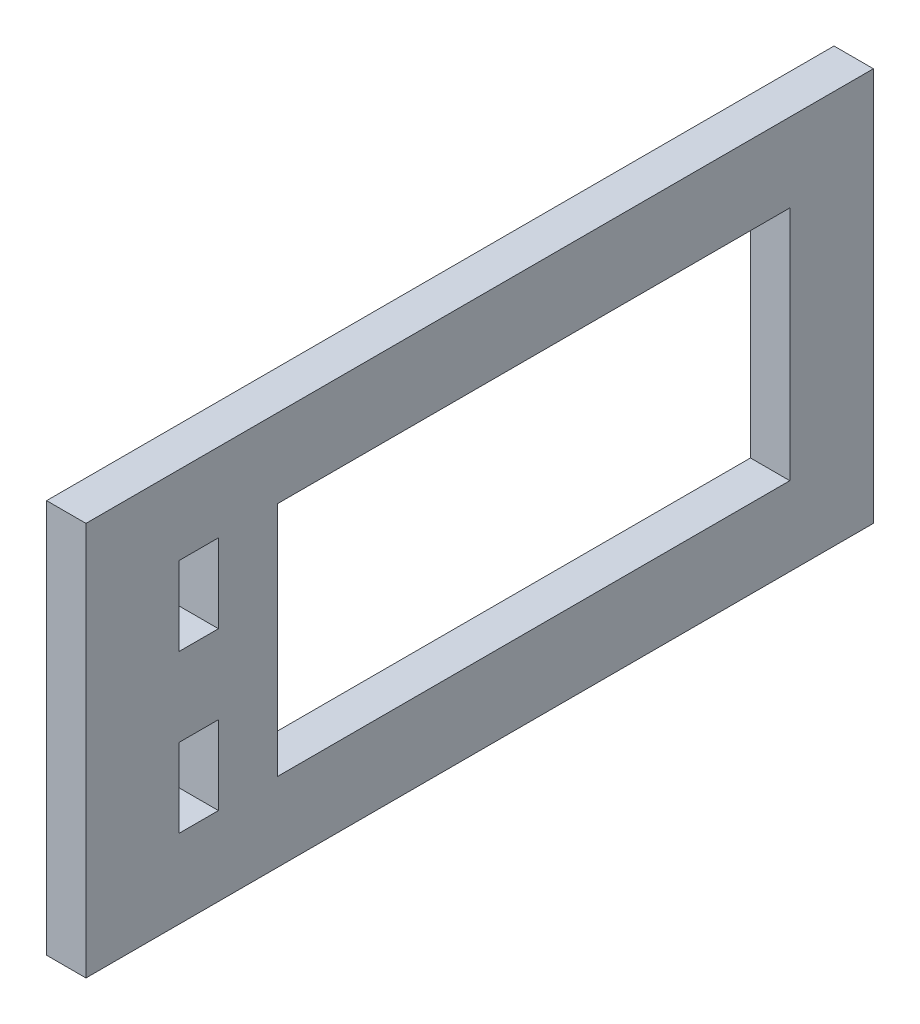
ISO-10303-21;
HEADER;
FILE_DESCRIPTION(('STEP AP214'),'2;1');
FILE_NAME('part.step','',(''),(''),'','','');
FILE_SCHEMA(('AUTOMOTIVE_DESIGN { 1 0 10303 214 1 1 1 1 }'));
ENDSEC;
DATA;
#1=APPLICATION_CONTEXT('core data for automotive mechanical design processes');
#2=APPLICATION_PROTOCOL_DEFINITION('international standard','automotive_design',2000,#1);
#3=PRODUCT_CONTEXT('',#1,'mechanical');
#4=PRODUCT('Part','Part','',(#3));
#5=PRODUCT_RELATED_PRODUCT_CATEGORY('part','',(#4));
#6=PRODUCT_DEFINITION_FORMATION('','',#4);
#7=PRODUCT_DEFINITION_CONTEXT('part definition',#1,'design');
#8=PRODUCT_DEFINITION('design','',#6,#7);
#9=PRODUCT_DEFINITION_SHAPE('','',#8);
#10=(LENGTH_UNIT() NAMED_UNIT(*) SI_UNIT(.MILLI.,.METRE.));
#11=(NAMED_UNIT(*) PLANE_ANGLE_UNIT() SI_UNIT($,.RADIAN.));
#12=(NAMED_UNIT(*) SI_UNIT($,.STERADIAN.) SOLID_ANGLE_UNIT());
#13=UNCERTAINTY_MEASURE_WITH_UNIT(LENGTH_MEASURE(1.E-05),#10,'distance_accuracy_value','');
#14=(GEOMETRIC_REPRESENTATION_CONTEXT(3) GLOBAL_UNCERTAINTY_ASSIGNED_CONTEXT((#13)) GLOBAL_UNIT_ASSIGNED_CONTEXT((#10,
#11,#12)) REPRESENTATION_CONTEXT('',''));
#15=CARTESIAN_POINT('',(0.,0.,0.));
#16=DIRECTION('',(0.,0.,1.));
#17=DIRECTION('',(1.,0.,0.));
#18=AXIS2_PLACEMENT_3D('',#15,#16,#17);
#19=CARTESIAN_POINT('',(5.,0.,0.));
#20=DIRECTION('',(1.,0.,0.));
#21=DIRECTION('',(0.,0.,-1.));
#22=AXIS2_PLACEMENT_3D('',#19,#20,#21);
#23=PLANE('',#22);
#24=DIRECTION('',(0.,1.,0.));
#25=VECTOR('',#24,1.);
#26=CARTESIAN_POINT('',(5.,0.,0.));
#27=LINE('',#26,#25);
#28=CARTESIAN_POINT('',(5.,0.,0.));
#29=VERTEX_POINT('',#28);
#30=CARTESIAN_POINT('',(5.,50.,0.));
#31=VERTEX_POINT('',#30);
#32=EDGE_CURVE('E288',#29,#31,#27,.T.);
#33=ORIENTED_EDGE('',*,*,#32,.T.);
#34=DIRECTION('',(0.,0.,1.));
#35=VECTOR('',#34,1.);
#36=CARTESIAN_POINT('',(5.,50.,0.));
#37=LINE('',#36,#35);
#38=CARTESIAN_POINT('',(5.,50.,100.));
#39=VERTEX_POINT('',#38);
#40=EDGE_CURVE('E292',#31,#39,#37,.T.);
#41=ORIENTED_EDGE('',*,*,#40,.T.);
#42=DIRECTION('',(0.,-1.,0.));
#43=VECTOR('',#42,1.);
#44=CARTESIAN_POINT('',(5.,0.,100.));
#45=LINE('',#44,#43);
#46=CARTESIAN_POINT('',(5.,0.,100.));
#47=VERTEX_POINT('',#46);
#48=EDGE_CURVE('E296',#39,#47,#45,.T.);
#49=ORIENTED_EDGE('',*,*,#48,.T.);
#50=DIRECTION('',(0.,0.,-1.));
#51=VECTOR('',#50,1.);
#52=CARTESIAN_POINT('',(5.,0.,0.));
#53=LINE('',#52,#51);
#54=EDGE_CURVE('E299',#47,#29,#53,.T.);
#55=ORIENTED_EDGE('',*,*,#54,.T.);
#56=EDGE_LOOP('',(#33,#41,#49,#55));
#57=FACE_BOUND('',#56,.T.);
#58=DIRECTION('',(0.,0.,-1.));
#59=VECTOR('',#58,1.);
#60=CARTESIAN_POINT('',(5.,30.,88.1740083163723));
#61=LINE('',#60,#59);
#62=CARTESIAN_POINT('',(5.,30.,88.1740083163723));
#63=VERTEX_POINT('',#62);
#64=CARTESIAN_POINT('',(5.,30.,83.1740083163723));
#65=VERTEX_POINT('',#64);
#66=EDGE_CURVE('E249',#63,#65,#61,.T.);
#67=ORIENTED_EDGE('',*,*,#66,.F.);
#68=DIRECTION('',(0.,-1.,0.));
#69=VECTOR('',#68,1.);
#70=CARTESIAN_POINT('',(5.,40.,88.1740083163723));
#71=LINE('',#70,#69);
#72=CARTESIAN_POINT('',(5.,40.,88.1740083163723));
#73=VERTEX_POINT('',#72);
#74=EDGE_CURVE('E246',#73,#63,#71,.T.);
#75=ORIENTED_EDGE('',*,*,#74,.F.);
#76=DIRECTION('',(0.,0.,1.));
#77=VECTOR('',#76,1.);
#78=CARTESIAN_POINT('',(5.,40.,88.1740083163723));
#79=LINE('',#78,#77);
#80=CARTESIAN_POINT('',(5.,40.,83.1740083163723));
#81=VERTEX_POINT('',#80);
#82=EDGE_CURVE('E257',#81,#73,#79,.T.);
#83=ORIENTED_EDGE('',*,*,#82,.F.);
#84=DIRECTION('',(0.,1.,0.));
#85=VECTOR('',#84,1.);
#86=CARTESIAN_POINT('',(5.,40.,83.1740083163723));
#87=LINE('',#86,#85);
#88=EDGE_CURVE('E253',#65,#81,#87,.T.);
#89=ORIENTED_EDGE('',*,*,#88,.F.);
#90=EDGE_LOOP('',(#67,#75,#83,#89));
#91=FACE_BOUND('',#90,.T.);
#92=DIRECTION('',(0.,0.,-1.));
#93=VECTOR('',#92,1.);
#94=CARTESIAN_POINT('',(5.,9.99999999999999,88.1740083163723));
#95=LINE('',#94,#93);
#96=CARTESIAN_POINT('',(5.,9.99999999999999,88.1740083163723));
#97=VERTEX_POINT('',#96);
#98=CARTESIAN_POINT('',(5.,9.99999999999999,83.1740083163723));
#99=VERTEX_POINT('',#98);
#100=EDGE_CURVE('E207',#97,#99,#95,.T.);
#101=ORIENTED_EDGE('',*,*,#100,.F.);
#102=DIRECTION('',(0.,-1.,0.));
#103=VECTOR('',#102,1.);
#104=CARTESIAN_POINT('',(5.,20.,88.1740083163723));
#105=LINE('',#104,#103);
#106=CARTESIAN_POINT('',(5.,20.,88.1740083163723));
#107=VERTEX_POINT('',#106);
#108=EDGE_CURVE('E204',#107,#97,#105,.T.);
#109=ORIENTED_EDGE('',*,*,#108,.F.);
#110=DIRECTION('',(0.,0.,1.));
#111=VECTOR('',#110,1.);
#112=CARTESIAN_POINT('',(5.,20.,88.1740083163723));
#113=LINE('',#112,#111);
#114=CARTESIAN_POINT('',(5.,20.,83.1740083163723));
#115=VERTEX_POINT('',#114);
#116=EDGE_CURVE('E215',#115,#107,#113,.T.);
#117=ORIENTED_EDGE('',*,*,#116,.F.);
#118=DIRECTION('',(0.,1.,0.));
#119=VECTOR('',#118,1.);
#120=CARTESIAN_POINT('',(5.,20.,83.1740083163723));
#121=LINE('',#120,#119);
#122=EDGE_CURVE('E211',#99,#115,#121,.T.);
#123=ORIENTED_EDGE('',*,*,#122,.F.);
#124=EDGE_LOOP('',(#101,#109,#117,#123));
#125=FACE_BOUND('',#124,.T.);
#126=DIRECTION('',(0.,0.,-1.));
#127=VECTOR('',#126,1.);
#128=CARTESIAN_POINT('',(5.,9.99999999999999,75.6517256733827));
#129=LINE('',#128,#127);
#130=CARTESIAN_POINT('',(5.,9.99999999999999,75.6517256733827));
#131=VERTEX_POINT('',#130);
#132=CARTESIAN_POINT('',(5.,9.99999999999999,10.6154443337674));
#133=VERTEX_POINT('',#132);
#134=EDGE_CURVE('E163',#131,#133,#129,.T.);
#135=ORIENTED_EDGE('',*,*,#134,.F.);
#136=DIRECTION('',(0.,-1.,0.));
#137=VECTOR('',#136,1.);
#138=CARTESIAN_POINT('',(5.,40.,75.6517256733827));
#139=LINE('',#138,#137);
#140=CARTESIAN_POINT('',(5.,40.,75.6517256733827));
#141=VERTEX_POINT('',#140);
#142=EDGE_CURVE('E154',#141,#131,#139,.T.);
#143=ORIENTED_EDGE('',*,*,#142,.F.);
#144=DIRECTION('',(0.,0.,1.));
#145=VECTOR('',#144,1.);
#146=CARTESIAN_POINT('',(5.,40.,75.6517256733827));
#147=LINE('',#146,#145);
#148=CARTESIAN_POINT('',(5.,40.,10.6154443337674));
#149=VERTEX_POINT('',#148);
#150=EDGE_CURVE('E182',#149,#141,#147,.T.);
#151=ORIENTED_EDGE('',*,*,#150,.F.);
#152=DIRECTION('',(0.,1.,0.));
#153=VECTOR('',#152,1.);
#154=CARTESIAN_POINT('',(5.,40.,10.6154443337674));
#155=LINE('',#154,#153);
#156=EDGE_CURVE('E176',#133,#149,#155,.T.);
#157=ORIENTED_EDGE('',*,*,#156,.F.);
#158=EDGE_LOOP('',(#135,#143,#151,#157));
#159=FACE_BOUND('',#158,.T.);
#160=ADVANCED_FACE('F40',(#57,#91,#125,#159),#23,.T.);
#161=CARTESIAN_POINT('',(0.,0.,0.));
#162=DIRECTION('',(1.,0.,0.));
#163=DIRECTION('',(0.,0.,-1.));
#164=AXIS2_PLACEMENT_3D('',#161,#162,#163);
#165=PLANE('',#164);
#166=DIRECTION('',(0.,-1.,0.));
#167=VECTOR('',#166,1.);
#168=CARTESIAN_POINT('',(0.,20.,88.1740083163723));
#169=LINE('',#168,#167);
#170=CARTESIAN_POINT('',(0.,20.,88.1740083163723));
#171=VERTEX_POINT('',#170);
#172=CARTESIAN_POINT('',(0.,9.99999999999999,88.1740083163723));
#173=VERTEX_POINT('',#172);
#174=EDGE_CURVE('E172',#171,#173,#169,.T.);
#175=ORIENTED_EDGE('',*,*,#174,.T.);
#176=DIRECTION('',(0.,0.,-1.));
#177=VECTOR('',#176,1.);
#178=CARTESIAN_POINT('',(0.,9.99999999999999,88.1740083163723));
#179=LINE('',#178,#177);
#180=CARTESIAN_POINT('',(0.,9.99999999999999,83.1740083163723));
#181=VERTEX_POINT('',#180);
#182=EDGE_CURVE('E222',#173,#181,#179,.T.);
#183=ORIENTED_EDGE('',*,*,#182,.T.);
#184=DIRECTION('',(0.,1.,0.));
#185=VECTOR('',#184,1.);
#186=CARTESIAN_POINT('',(0.,20.,83.1740083163723));
#187=LINE('',#186,#185);
#188=CARTESIAN_POINT('',(0.,20.,83.1740083163723));
#189=VERTEX_POINT('',#188);
#190=EDGE_CURVE('E226',#181,#189,#187,.T.);
#191=ORIENTED_EDGE('',*,*,#190,.T.);
#192=DIRECTION('',(0.,0.,1.));
#193=VECTOR('',#192,1.);
#194=CARTESIAN_POINT('',(0.,20.,88.1740083163723));
#195=LINE('',#194,#193);
#196=EDGE_CURVE('E208',#189,#171,#195,.T.);
#197=ORIENTED_EDGE('',*,*,#196,.T.);
#198=EDGE_LOOP('',(#175,#183,#191,#197));
#199=FACE_BOUND('',#198,.T.);
#200=DIRECTION('',(0.,1.,0.));
#201=VECTOR('',#200,1.);
#202=CARTESIAN_POINT('',(0.,0.,0.));
#203=LINE('',#202,#201);
#204=CARTESIAN_POINT('',(0.,0.,0.));
#205=VERTEX_POINT('',#204);
#206=CARTESIAN_POINT('',(0.,50.,0.));
#207=VERTEX_POINT('',#206);
#208=EDGE_CURVE('E287',#205,#207,#203,.T.);
#209=ORIENTED_EDGE('',*,*,#208,.F.);
#210=DIRECTION('',(0.,0.,-1.));
#211=VECTOR('',#210,1.);
#212=CARTESIAN_POINT('',(0.,0.,0.));
#213=LINE('',#212,#211);
#214=CARTESIAN_POINT('',(0.,0.,100.));
#215=VERTEX_POINT('',#214);
#216=EDGE_CURVE('E293',#215,#205,#213,.T.);
#217=ORIENTED_EDGE('',*,*,#216,.F.);
#218=DIRECTION('',(0.,-1.,0.));
#219=VECTOR('',#218,1.);
#220=CARTESIAN_POINT('',(0.,0.,100.));
#221=LINE('',#220,#219);
#222=CARTESIAN_POINT('',(0.,50.,100.));
#223=VERTEX_POINT('',#222);
#224=EDGE_CURVE('E309',#223,#215,#221,.T.);
#225=ORIENTED_EDGE('',*,*,#224,.F.);
#226=DIRECTION('',(0.,0.,1.));
#227=VECTOR('',#226,1.);
#228=CARTESIAN_POINT('',(0.,50.,0.));
#229=LINE('',#228,#227);
#230=EDGE_CURVE('E306',#207,#223,#229,.T.);
#231=ORIENTED_EDGE('',*,*,#230,.F.);
#232=EDGE_LOOP('',(#209,#217,#225,#231));
#233=FACE_BOUND('',#232,.T.);
#234=DIRECTION('',(0.,-1.,0.));
#235=VECTOR('',#234,1.);
#236=CARTESIAN_POINT('',(0.,40.,88.1740083163723));
#237=LINE('',#236,#235);
#238=CARTESIAN_POINT('',(0.,40.,88.1740083163723));
#239=VERTEX_POINT('',#238);
#240=CARTESIAN_POINT('',(0.,30.,88.1740083163723));
#241=VERTEX_POINT('',#240);
#242=EDGE_CURVE('E245',#239,#241,#237,.T.);
#243=ORIENTED_EDGE('',*,*,#242,.T.);
#244=DIRECTION('',(0.,0.,-1.));
#245=VECTOR('',#244,1.);
#246=CARTESIAN_POINT('',(0.,30.,88.1740083163723));
#247=LINE('',#246,#245);
#248=CARTESIAN_POINT('',(0.,30.,83.1740083163723));
#249=VERTEX_POINT('',#248);
#250=EDGE_CURVE('E264',#241,#249,#247,.T.);
#251=ORIENTED_EDGE('',*,*,#250,.T.);
#252=DIRECTION('',(0.,1.,0.));
#253=VECTOR('',#252,1.);
#254=CARTESIAN_POINT('',(0.,40.,83.1740083163723));
#255=LINE('',#254,#253);
#256=CARTESIAN_POINT('',(0.,40.,83.1740083163723));
#257=VERTEX_POINT('',#256);
#258=EDGE_CURVE('E268',#249,#257,#255,.T.);
#259=ORIENTED_EDGE('',*,*,#258,.T.);
#260=DIRECTION('',(0.,0.,1.));
#261=VECTOR('',#260,1.);
#262=CARTESIAN_POINT('',(0.,40.,88.1740083163723));
#263=LINE('',#262,#261);
#264=EDGE_CURVE('E250',#257,#239,#263,.T.);
#265=ORIENTED_EDGE('',*,*,#264,.T.);
#266=EDGE_LOOP('',(#243,#251,#259,#265));
#267=FACE_BOUND('',#266,.T.);
#268=DIRECTION('',(0.,-1.,0.));
#269=VECTOR('',#268,1.);
#270=CARTESIAN_POINT('',(0.,40.,75.6517256733827));
#271=LINE('',#270,#269);
#272=CARTESIAN_POINT('',(0.,40.,75.6517256733827));
#273=VERTEX_POINT('',#272);
#274=CARTESIAN_POINT('',(0.,9.99999999999999,75.6517256733827));
#275=VERTEX_POINT('',#274);
#276=EDGE_CURVE('E64',#273,#275,#271,.T.);
#277=ORIENTED_EDGE('',*,*,#276,.T.);
#278=DIRECTION('',(0.,0.,-1.));
#279=VECTOR('',#278,1.);
#280=CARTESIAN_POINT('',(0.,9.99999999999999,75.6517256733827));
#281=LINE('',#280,#279);
#282=CARTESIAN_POINT('',(0.,9.99999999999999,10.6154443337674));
#283=VERTEX_POINT('',#282);
#284=EDGE_CURVE('E170',#275,#283,#281,.T.);
#285=ORIENTED_EDGE('',*,*,#284,.T.);
#286=DIRECTION('',(0.,1.,0.));
#287=VECTOR('',#286,1.);
#288=CARTESIAN_POINT('',(0.,40.,10.6154443337674));
#289=LINE('',#288,#287);
#290=CARTESIAN_POINT('',(0.,40.,10.6154443337674));
#291=VERTEX_POINT('',#290);
#292=EDGE_CURVE('E191',#283,#291,#289,.T.);
#293=ORIENTED_EDGE('',*,*,#292,.T.);
#294=DIRECTION('',(0.,0.,1.));
#295=VECTOR('',#294,1.);
#296=CARTESIAN_POINT('',(0.,40.,75.6517256733827));
#297=LINE('',#296,#295);
#298=EDGE_CURVE('E164',#291,#273,#297,.T.);
#299=ORIENTED_EDGE('',*,*,#298,.T.);
#300=EDGE_LOOP('',(#277,#285,#293,#299));
#301=FACE_BOUND('',#300,.T.);
#302=ADVANCED_FACE('F332',(#199,#233,#267,#301),#165,.F.);
#303=CARTESIAN_POINT('',(5.,0.,0.));
#304=DIRECTION('',(0.,0.,1.));
#305=DIRECTION('',(0.,-1.,0.));
#306=AXIS2_PLACEMENT_3D('',#303,#304,#305);
#307=PLANE('',#306);
#308=ORIENTED_EDGE('',*,*,#208,.T.);
#309=DIRECTION('',(-1.,0.,0.));
#310=VECTOR('',#309,1.);
#311=CARTESIAN_POINT('',(5.,50.,0.));
#312=LINE('',#311,#310);
#313=EDGE_CURVE('E11',#31,#207,#312,.T.);
#314=ORIENTED_EDGE('',*,*,#313,.F.);
#315=ORIENTED_EDGE('',*,*,#32,.F.);
#316=DIRECTION('',(-1.,0.,0.));
#317=VECTOR('',#316,1.);
#318=CARTESIAN_POINT('',(5.,0.,0.));
#319=LINE('',#318,#317);
#320=EDGE_CURVE('E302',#29,#205,#319,.T.);
#321=ORIENTED_EDGE('',*,*,#320,.T.);
#322=EDGE_LOOP('',(#308,#314,#315,#321));
#323=FACE_BOUND('',#322,.T.);
#324=ADVANCED_FACE('F42',(#323),#307,.F.);
#325=CARTESIAN_POINT('',(5.,50.,0.));
#326=DIRECTION('',(0.,-1.,0.));
#327=DIRECTION('',(0.,0.,-1.));
#328=AXIS2_PLACEMENT_3D('',#325,#326,#327);
#329=PLANE('',#328);
#330=ORIENTED_EDGE('',*,*,#230,.T.);
#331=DIRECTION('',(-1.,0.,0.));
#332=VECTOR('',#331,1.);
#333=CARTESIAN_POINT('',(5.,50.,100.));
#334=LINE('',#333,#332);
#335=EDGE_CURVE('E49',#39,#223,#334,.T.);
#336=ORIENTED_EDGE('',*,*,#335,.F.);
#337=ORIENTED_EDGE('',*,*,#40,.F.);
#338=ORIENTED_EDGE('',*,*,#313,.T.);
#339=EDGE_LOOP('',(#330,#336,#337,#338));
#340=FACE_BOUND('',#339,.T.);
#341=ADVANCED_FACE('F343',(#340),#329,.F.);
#342=CARTESIAN_POINT('',(5.,0.,100.));
#343=DIRECTION('',(0.,0.,-1.));
#344=DIRECTION('',(-1.,0.,0.));
#345=AXIS2_PLACEMENT_3D('',#342,#343,#344);
#346=PLANE('',#345);
#347=ORIENTED_EDGE('',*,*,#224,.T.);
#348=DIRECTION('',(-1.,0.,0.));
#349=VECTOR('',#348,1.);
#350=CARTESIAN_POINT('',(5.,0.,100.));
#351=LINE('',#350,#349);
#352=EDGE_CURVE('E317',#47,#215,#351,.T.);
#353=ORIENTED_EDGE('',*,*,#352,.F.);
#354=ORIENTED_EDGE('',*,*,#48,.F.);
#355=ORIENTED_EDGE('',*,*,#335,.T.);
#356=EDGE_LOOP('',(#347,#353,#354,#355));
#357=FACE_BOUND('',#356,.T.);
#358=ADVANCED_FACE('F326',(#357),#346,.F.);
#359=CARTESIAN_POINT('',(5.,0.,0.));
#360=DIRECTION('',(0.,1.,0.));
#361=DIRECTION('',(0.,0.,1.));
#362=AXIS2_PLACEMENT_3D('',#359,#360,#361);
#363=PLANE('',#362);
#364=ORIENTED_EDGE('',*,*,#216,.T.);
#365=ORIENTED_EDGE('',*,*,#320,.F.);
#366=ORIENTED_EDGE('',*,*,#54,.F.);
#367=ORIENTED_EDGE('',*,*,#352,.T.);
#368=EDGE_LOOP('',(#364,#365,#366,#367));
#369=FACE_BOUND('',#368,.T.);
#370=ADVANCED_FACE('F336',(#369),#363,.F.);
#371=CARTESIAN_POINT('',(5.,40.,88.1740083163723));
#372=DIRECTION('',(0.,0.,-1.));
#373=DIRECTION('',(-1.,0.,0.));
#374=AXIS2_PLACEMENT_3D('',#371,#372,#373);
#375=PLANE('',#374);
#376=ORIENTED_EDGE('',*,*,#242,.F.);
#377=DIRECTION('',(-1.,0.,0.));
#378=VECTOR('',#377,1.);
#379=CARTESIAN_POINT('',(5.,40.,88.1740083163723));
#380=LINE('',#379,#378);
#381=EDGE_CURVE('E260',#73,#239,#380,.T.);
#382=ORIENTED_EDGE('',*,*,#381,.F.);
#383=ORIENTED_EDGE('',*,*,#74,.T.);
#384=DIRECTION('',(-1.,0.,0.));
#385=VECTOR('',#384,1.);
#386=CARTESIAN_POINT('',(5.,30.,88.1740083163723));
#387=LINE('',#386,#385);
#388=EDGE_CURVE('E283',#63,#241,#387,.T.);
#389=ORIENTED_EDGE('',*,*,#388,.T.);
#390=EDGE_LOOP('',(#376,#382,#383,#389));
#391=FACE_BOUND('',#390,.T.);
#392=ADVANCED_FACE('F358',(#391),#375,.T.);
#393=CARTESIAN_POINT('',(5.,30.,88.1740083163723));
#394=DIRECTION('',(0.,1.,0.));
#395=DIRECTION('',(0.,0.,1.));
#396=AXIS2_PLACEMENT_3D('',#393,#394,#395);
#397=PLANE('',#396);
#398=ORIENTED_EDGE('',*,*,#250,.F.);
#399=ORIENTED_EDGE('',*,*,#388,.F.);
#400=ORIENTED_EDGE('',*,*,#66,.T.);
#401=DIRECTION('',(-1.,0.,0.));
#402=VECTOR('',#401,1.);
#403=CARTESIAN_POINT('',(5.,30.,83.1740083163723));
#404=LINE('',#403,#402);
#405=EDGE_CURVE('E280',#65,#249,#404,.T.);
#406=ORIENTED_EDGE('',*,*,#405,.T.);
#407=EDGE_LOOP('',(#398,#399,#400,#406));
#408=FACE_BOUND('',#407,.T.);
#409=ADVANCED_FACE('F365',(#408),#397,.T.);
#410=CARTESIAN_POINT('',(5.,40.,83.1740083163723));
#411=DIRECTION('',(0.,0.,1.));
#412=DIRECTION('',(1.,0.,0.));
#413=AXIS2_PLACEMENT_3D('',#410,#411,#412);
#414=PLANE('',#413);
#415=ORIENTED_EDGE('',*,*,#258,.F.);
#416=ORIENTED_EDGE('',*,*,#405,.F.);
#417=ORIENTED_EDGE('',*,*,#88,.T.);
#418=DIRECTION('',(-1.,0.,0.));
#419=VECTOR('',#418,1.);
#420=CARTESIAN_POINT('',(5.,40.,83.1740083163723));
#421=LINE('',#420,#419);
#422=EDGE_CURVE('E278',#81,#257,#421,.T.);
#423=ORIENTED_EDGE('',*,*,#422,.T.);
#424=EDGE_LOOP('',(#415,#416,#417,#423));
#425=FACE_BOUND('',#424,.T.);
#426=ADVANCED_FACE('F370',(#425),#414,.T.);
#427=CARTESIAN_POINT('',(5.,40.,88.1740083163723));
#428=DIRECTION('',(0.,-1.,0.));
#429=DIRECTION('',(0.,0.,-1.));
#430=AXIS2_PLACEMENT_3D('',#427,#428,#429);
#431=PLANE('',#430);
#432=ORIENTED_EDGE('',*,*,#264,.F.);
#433=ORIENTED_EDGE('',*,*,#422,.F.);
#434=ORIENTED_EDGE('',*,*,#82,.T.);
#435=ORIENTED_EDGE('',*,*,#381,.T.);
#436=EDGE_LOOP('',(#432,#433,#434,#435));
#437=FACE_BOUND('',#436,.T.);
#438=ADVANCED_FACE('F377',(#437),#431,.T.);
#439=CARTESIAN_POINT('',(5.,20.,88.1740083163723));
#440=DIRECTION('',(0.,0.,-1.));
#441=DIRECTION('',(-1.,0.,0.));
#442=AXIS2_PLACEMENT_3D('',#439,#440,#441);
#443=PLANE('',#442);
#444=ORIENTED_EDGE('',*,*,#174,.F.);
#445=DIRECTION('',(-1.,0.,0.));
#446=VECTOR('',#445,1.);
#447=CARTESIAN_POINT('',(5.,20.,88.1740083163723));
#448=LINE('',#447,#446);
#449=EDGE_CURVE('E218',#107,#171,#448,.T.);
#450=ORIENTED_EDGE('',*,*,#449,.F.);
#451=ORIENTED_EDGE('',*,*,#108,.T.);
#452=DIRECTION('',(-1.,0.,0.));
#453=VECTOR('',#452,1.);
#454=CARTESIAN_POINT('',(5.,9.99999999999999,88.1740083163723));
#455=LINE('',#454,#453);
#456=EDGE_CURVE('E241',#97,#173,#455,.T.);
#457=ORIENTED_EDGE('',*,*,#456,.T.);
#458=EDGE_LOOP('',(#444,#450,#451,#457));
#459=FACE_BOUND('',#458,.T.);
#460=ADVANCED_FACE('F399',(#459),#443,.T.);
#461=CARTESIAN_POINT('',(5.,9.99999999999999,88.1740083163723));
#462=DIRECTION('',(0.,1.,0.));
#463=DIRECTION('',(0.,0.,1.));
#464=AXIS2_PLACEMENT_3D('',#461,#462,#463);
#465=PLANE('',#464);
#466=ORIENTED_EDGE('',*,*,#182,.F.);
#467=ORIENTED_EDGE('',*,*,#456,.F.);
#468=ORIENTED_EDGE('',*,*,#100,.T.);
#469=DIRECTION('',(-1.,0.,0.));
#470=VECTOR('',#469,1.);
#471=CARTESIAN_POINT('',(5.,9.99999999999999,83.1740083163723));
#472=LINE('',#471,#470);
#473=EDGE_CURVE('E238',#99,#181,#472,.T.);
#474=ORIENTED_EDGE('',*,*,#473,.T.);
#475=EDGE_LOOP('',(#466,#467,#468,#474));
#476=FACE_BOUND('',#475,.T.);
#477=ADVANCED_FACE('F393',(#476),#465,.T.);
#478=CARTESIAN_POINT('',(5.,20.,83.1740083163723));
#479=DIRECTION('',(0.,0.,1.));
#480=DIRECTION('',(1.,0.,0.));
#481=AXIS2_PLACEMENT_3D('',#478,#479,#480);
#482=PLANE('',#481);
#483=ORIENTED_EDGE('',*,*,#190,.F.);
#484=ORIENTED_EDGE('',*,*,#473,.F.);
#485=ORIENTED_EDGE('',*,*,#122,.T.);
#486=DIRECTION('',(-1.,0.,0.));
#487=VECTOR('',#486,1.);
#488=CARTESIAN_POINT('',(5.,20.,83.1740083163723));
#489=LINE('',#488,#487);
#490=EDGE_CURVE('E235',#115,#189,#489,.T.);
#491=ORIENTED_EDGE('',*,*,#490,.T.);
#492=EDGE_LOOP('',(#483,#484,#485,#491));
#493=FACE_BOUND('',#492,.T.);
#494=ADVANCED_FACE('F396',(#493),#482,.T.);
#495=CARTESIAN_POINT('',(5.,20.,88.1740083163723));
#496=DIRECTION('',(0.,-1.,0.));
#497=DIRECTION('',(0.,0.,-1.));
#498=AXIS2_PLACEMENT_3D('',#495,#496,#497);
#499=PLANE('',#498);
#500=ORIENTED_EDGE('',*,*,#196,.F.);
#501=ORIENTED_EDGE('',*,*,#490,.F.);
#502=ORIENTED_EDGE('',*,*,#116,.T.);
#503=ORIENTED_EDGE('',*,*,#449,.T.);
#504=EDGE_LOOP('',(#500,#501,#502,#503));
#505=FACE_BOUND('',#504,.T.);
#506=ADVANCED_FACE('F402',(#505),#499,.T.);
#507=CARTESIAN_POINT('',(5.,40.,75.6517256733827));
#508=DIRECTION('',(0.,0.,-1.));
#509=DIRECTION('',(-1.,0.,0.));
#510=AXIS2_PLACEMENT_3D('',#507,#508,#509);
#511=PLANE('',#510);
#512=ORIENTED_EDGE('',*,*,#276,.F.);
#513=DIRECTION('',(-1.,0.,0.));
#514=VECTOR('',#513,1.);
#515=CARTESIAN_POINT('',(5.,40.,75.6517256733827));
#516=LINE('',#515,#514);
#517=EDGE_CURVE('E158',#141,#273,#516,.T.);
#518=ORIENTED_EDGE('',*,*,#517,.F.);
#519=ORIENTED_EDGE('',*,*,#142,.T.);
#520=DIRECTION('',(-1.,0.,0.));
#521=VECTOR('',#520,1.);
#522=CARTESIAN_POINT('',(5.,9.99999999999999,75.6517256733827));
#523=LINE('',#522,#521);
#524=EDGE_CURVE('E157',#131,#275,#523,.T.);
#525=ORIENTED_EDGE('',*,*,#524,.T.);
#526=EDGE_LOOP('',(#512,#518,#519,#525));
#527=FACE_BOUND('',#526,.T.);
#528=ADVANCED_FACE('F156',(#527),#511,.T.);
#529=CARTESIAN_POINT('',(5.,9.99999999999999,75.6517256733827));
#530=DIRECTION('',(0.,1.,0.));
#531=DIRECTION('',(0.,0.,1.));
#532=AXIS2_PLACEMENT_3D('',#529,#530,#531);
#533=PLANE('',#532);
#534=ORIENTED_EDGE('',*,*,#284,.F.);
#535=ORIENTED_EDGE('',*,*,#524,.F.);
#536=ORIENTED_EDGE('',*,*,#134,.T.);
#537=DIRECTION('',(-1.,0.,0.));
#538=VECTOR('',#537,1.);
#539=CARTESIAN_POINT('',(5.,9.99999999999999,10.6154443337674));
#540=LINE('',#539,#538);
#541=EDGE_CURVE('E173',#133,#283,#540,.T.);
#542=ORIENTED_EDGE('',*,*,#541,.T.);
#543=EDGE_LOOP('',(#534,#535,#536,#542));
#544=FACE_BOUND('',#543,.T.);
#545=ADVANCED_FACE('F167',(#544),#533,.T.);
#546=CARTESIAN_POINT('',(5.,40.,10.6154443337674));
#547=DIRECTION('',(0.,0.,1.));
#548=DIRECTION('',(1.,0.,0.));
#549=AXIS2_PLACEMENT_3D('',#546,#547,#548);
#550=PLANE('',#549);
#551=ORIENTED_EDGE('',*,*,#292,.F.);
#552=ORIENTED_EDGE('',*,*,#541,.F.);
#553=ORIENTED_EDGE('',*,*,#156,.T.);
#554=DIRECTION('',(-1.,0.,0.));
#555=VECTOR('',#554,1.);
#556=CARTESIAN_POINT('',(5.,40.,10.6154443337674));
#557=LINE('',#556,#555);
#558=EDGE_CURVE('E56',#149,#291,#557,.T.);
#559=ORIENTED_EDGE('',*,*,#558,.T.);
#560=EDGE_LOOP('',(#551,#552,#553,#559));
#561=FACE_BOUND('',#560,.T.);
#562=ADVANCED_FACE('F451',(#561),#550,.T.);
#563=CARTESIAN_POINT('',(5.,40.,75.6517256733827));
#564=DIRECTION('',(0.,-1.,0.));
#565=DIRECTION('',(0.,0.,-1.));
#566=AXIS2_PLACEMENT_3D('',#563,#564,#565);
#567=PLANE('',#566);
#568=ORIENTED_EDGE('',*,*,#298,.F.);
#569=ORIENTED_EDGE('',*,*,#558,.F.);
#570=ORIENTED_EDGE('',*,*,#150,.T.);
#571=ORIENTED_EDGE('',*,*,#517,.T.);
#572=EDGE_LOOP('',(#568,#569,#570,#571));
#573=FACE_BOUND('',#572,.T.);
#574=ADVANCED_FACE('F458',(#573),#567,.T.);
#575=CLOSED_SHELL('',(#160,#302,#324,#341,#358,#370,#392,#409,#426,#438,#460,#477,#494,#506,
#528,#545,#562,#574));
#576=MANIFOLD_SOLID_BREP('B2',#575);
#577=ADVANCED_BREP_SHAPE_REPRESENTATION('',(#18,#576),#14);
#578=SHAPE_DEFINITION_REPRESENTATION(#9,#577);
ENDSEC;
END-ISO-10303-21;
